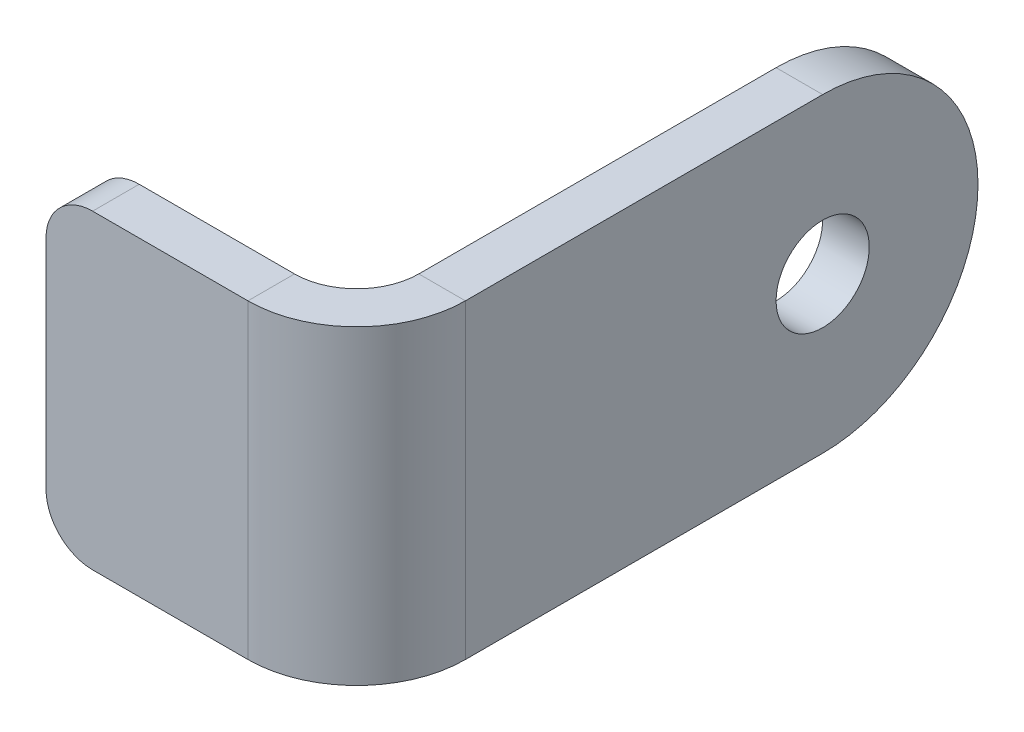
ISO-10303-21;
HEADER;
FILE_DESCRIPTION(('STEP AP214'),'2;1');
FILE_NAME('part.step','',(''),(''),'','','');
FILE_SCHEMA(('AUTOMOTIVE_DESIGN { 1 0 10303 214 1 1 1 1 }'));
ENDSEC;
DATA;
#1=APPLICATION_CONTEXT('core data for automotive mechanical design processes');
#2=APPLICATION_PROTOCOL_DEFINITION('international standard','automotive_design',2000,#1);
#3=PRODUCT_CONTEXT('',#1,'mechanical');
#4=PRODUCT('Part','Part','',(#3));
#5=PRODUCT_RELATED_PRODUCT_CATEGORY('part','',(#4));
#6=PRODUCT_DEFINITION_FORMATION('','',#4);
#7=PRODUCT_DEFINITION_CONTEXT('part definition',#1,'design');
#8=PRODUCT_DEFINITION('design','',#6,#7);
#9=PRODUCT_DEFINITION_SHAPE('','',#8);
#10=(LENGTH_UNIT() NAMED_UNIT(*) SI_UNIT(.MILLI.,.METRE.));
#11=(NAMED_UNIT(*) PLANE_ANGLE_UNIT() SI_UNIT($,.RADIAN.));
#12=(NAMED_UNIT(*) SI_UNIT($,.STERADIAN.) SOLID_ANGLE_UNIT());
#13=UNCERTAINTY_MEASURE_WITH_UNIT(LENGTH_MEASURE(1.E-05),#10,'distance_accuracy_value','');
#14=(GEOMETRIC_REPRESENTATION_CONTEXT(3) GLOBAL_UNCERTAINTY_ASSIGNED_CONTEXT((#13)) GLOBAL_UNIT_ASSIGNED_CONTEXT((#10,
#11,#12)) REPRESENTATION_CONTEXT('',''));
#15=CARTESIAN_POINT('',(0.,0.,0.));
#16=DIRECTION('',(0.,0.,1.));
#17=DIRECTION('',(1.,0.,0.));
#18=AXIS2_PLACEMENT_3D('',#15,#16,#17);
#19=CARTESIAN_POINT('',(-107.000000000002,9.99999999999995,-3.99999999999978));
#20=DIRECTION('',(0.,1.,0.));
#21=DIRECTION('',(0.,0.,1.00000000000001));
#22=AXIS2_PLACEMENT_3D('',#19,#20,#21);
#23=PLANE('',#22);
#24=DIRECTION('',(0.,0.,-1.00000000000001));
#25=VECTOR('',#24,1.);
#26=CARTESIAN_POINT('',(-107.000000000002,9.99999999999995,-3.99999999999978));
#27=LINE('',#26,#25);
#28=CARTESIAN_POINT('',(-107.000000000002,9.99999999999995,-3.99999999999978));
#29=VERTEX_POINT('',#28);
#30=CARTESIAN_POINT('',(-107.000000000002,9.9999999999999,-7.00000000000001));
#31=VERTEX_POINT('',#30);
#32=EDGE_CURVE('E134',#29,#31,#27,.T.);
#33=ORIENTED_EDGE('',*,*,#32,.F.);
#34=CARTESIAN_POINT('',(-107.000000000002,9.99999999999987,-10.9999999999999));
#35=DIRECTION('',(0.,-1.,0.));
#36=DIRECTION('',(0.,0.,-1.00000000000001));
#37=AXIS2_PLACEMENT_3D('',#34,#35,#36);
#38=CIRCLE('',#37,7.);
#39=CARTESIAN_POINT('',(-100.000000000002,10.0000000000007,-10.9999999999998));
#40=VERTEX_POINT('',#39);
#41=EDGE_CURVE('E128',#29,#40,#38,.F.);
#42=ORIENTED_EDGE('',*,*,#41,.T.);
#43=DIRECTION('',(1.00000000000001,0.,0.));
#44=VECTOR('',#43,1.);
#45=CARTESIAN_POINT('',(-103.000000000002,10.0000000000007,-11.));
#46=LINE('',#45,#44);
#47=CARTESIAN_POINT('',(-103.000000000002,10.0000000000007,-11.));
#48=VERTEX_POINT('',#47);
#49=EDGE_CURVE('E122',#48,#40,#46,.T.);
#50=ORIENTED_EDGE('',*,*,#49,.F.);
#51=CARTESIAN_POINT('',(-107.000000000002,9.99999999999987,-10.9999999999999));
#52=DIRECTION('',(0.,1.,0.));
#53=DIRECTION('',(1.00000000000001,0.,0.));
#54=AXIS2_PLACEMENT_3D('',#51,#52,#53);
#55=CIRCLE('',#54,4.);
#56=EDGE_CURVE('E126',#31,#48,#55,.T.);
#57=ORIENTED_EDGE('',*,*,#56,.F.);
#58=EDGE_LOOP('',(#33,#42,#50,#57));
#59=FACE_BOUND('',#58,.T.);
#60=ADVANCED_FACE('F40',(#59),#23,.T.);
#61=CARTESIAN_POINT('',(-103.000000000002,10.0000000000007,-11.));
#62=DIRECTION('',(0.,1.,0.));
#63=DIRECTION('',(0.,0.,1.00000000000001));
#64=AXIS2_PLACEMENT_3D('',#61,#62,#63);
#65=PLANE('',#64);
#66=DIRECTION('',(1.00000000000001,0.,0.));
#67=VECTOR('',#66,1.);
#68=CARTESIAN_POINT('',(-120.000000000002,10.0000000000001,-7.00000000000001));
#69=LINE('',#68,#67);
#70=CARTESIAN_POINT('',(-117.000000000001,9.99999999999993,-6.99999999999978));
#71=VERTEX_POINT('',#70);
#72=EDGE_CURVE('E160',#71,#31,#69,.T.);
#73=ORIENTED_EDGE('',*,*,#72,.F.);
#74=DIRECTION('',(0.,0.,-1.00000000000001));
#75=VECTOR('',#74,1.);
#76=CARTESIAN_POINT('',(-117.000000000002,10.,-10.9999999999998));
#77=LINE('',#76,#75);
#78=CARTESIAN_POINT('',(-117.000000000002,9.99999999999987,-3.99999999999967));
#79=VERTEX_POINT('',#78);
#80=EDGE_CURVE('E230',#71,#79,#77,.F.);
#81=ORIENTED_EDGE('',*,*,#80,.T.);
#82=DIRECTION('',(1.00000000000001,0.,0.));
#83=VECTOR('',#82,1.);
#84=CARTESIAN_POINT('',(-120.000000000002,10.,-4.));
#85=LINE('',#84,#83);
#86=EDGE_CURVE('E164',#79,#29,#85,.T.);
#87=ORIENTED_EDGE('',*,*,#86,.T.);
#88=ORIENTED_EDGE('',*,*,#32,.T.);
#89=EDGE_LOOP('',(#73,#81,#87,#88));
#90=FACE_BOUND('',#89,.T.);
#91=ADVANCED_FACE('F289',(#90),#65,.T.);
#92=CARTESIAN_POINT('',(-100.000000000001,-9.99999999999929,-10.9999999999998));
#93=DIRECTION('',(0.,-1.,0.));
#94=DIRECTION('',(0.,0.,-1.00000000000001));
#95=AXIS2_PLACEMENT_3D('',#92,#93,#94);
#96=PLANE('',#95);
#97=DIRECTION('',(-1.00000000000001,0.,0.));
#98=VECTOR('',#97,1.);
#99=CARTESIAN_POINT('',(-100.000000000001,-9.99999999999929,-10.9999999999998));
#100=LINE('',#99,#98);
#101=CARTESIAN_POINT('',(-100.000000000001,-9.99999999999929,-10.9999999999998));
#102=VERTEX_POINT('',#101);
#103=CARTESIAN_POINT('',(-103.000000000002,-9.99999999999926,-11.));
#104=VERTEX_POINT('',#103);
#105=EDGE_CURVE('E135',#102,#104,#100,.T.);
#106=ORIENTED_EDGE('',*,*,#105,.F.);
#107=CARTESIAN_POINT('',(-107.000000000002,-10.,-11.));
#108=DIRECTION('',(0.,-1.,0.));
#109=DIRECTION('',(0.,0.,-1.00000000000001));
#110=AXIS2_PLACEMENT_3D('',#107,#108,#109);
#111=CIRCLE('',#110,7.);
#112=CARTESIAN_POINT('',(-107.000000000002,-10.,-3.99999999999978));
#113=VERTEX_POINT('',#112);
#114=EDGE_CURVE('E188',#113,#102,#111,.F.);
#115=ORIENTED_EDGE('',*,*,#114,.F.);
#116=DIRECTION('',(0.,0.,1.00000000000001));
#117=VECTOR('',#116,1.);
#118=CARTESIAN_POINT('',(-107.000000000002,-10.,-6.9999999999999));
#119=LINE('',#118,#117);
#120=CARTESIAN_POINT('',(-107.000000000002,-10.,-6.9999999999999));
#121=VERTEX_POINT('',#120);
#122=EDGE_CURVE('E146',#121,#113,#119,.T.);
#123=ORIENTED_EDGE('',*,*,#122,.F.);
#124=CARTESIAN_POINT('',(-107.000000000002,-10.,-11.));
#125=DIRECTION('',(0.,1.,0.));
#126=DIRECTION('',(1.00000000000001,0.,0.));
#127=AXIS2_PLACEMENT_3D('',#124,#125,#126);
#128=CIRCLE('',#127,4.);
#129=EDGE_CURVE('E179',#121,#104,#128,.T.);
#130=ORIENTED_EDGE('',*,*,#129,.T.);
#131=EDGE_LOOP('',(#106,#115,#123,#130));
#132=FACE_BOUND('',#131,.T.);
#133=ADVANCED_FACE('F294',(#132),#96,.T.);
#134=CARTESIAN_POINT('',(-107.000000000002,-10.,-6.9999999999999));
#135=DIRECTION('',(0.,-1.,0.));
#136=DIRECTION('',(0.,0.,-1.00000000000001));
#137=AXIS2_PLACEMENT_3D('',#134,#135,#136);
#138=PLANE('',#137);
#139=DIRECTION('',(0.,0.,-1.00000000000001));
#140=VECTOR('',#139,1.);
#141=CARTESIAN_POINT('',(-103.000000000002,-9.9999999999994,-3.99999999999978));
#142=LINE('',#141,#140);
#143=CARTESIAN_POINT('',(-103.000000000002,-9.99999999999995,-34.));
#144=VERTEX_POINT('',#143);
#145=EDGE_CURVE('E141',#104,#144,#142,.T.);
#146=ORIENTED_EDGE('',*,*,#145,.T.);
#147=DIRECTION('',(1.00000000000001,0.,0.));
#148=VECTOR('',#147,1.);
#149=CARTESIAN_POINT('',(-107.000000000002,-9.99999999999995,-33.9999999999999));
#150=LINE('',#149,#148);
#151=CARTESIAN_POINT('',(-100.000000000001,-10.0000000000001,-34.));
#152=VERTEX_POINT('',#151);
#153=EDGE_CURVE('E11',#144,#152,#150,.T.);
#154=ORIENTED_EDGE('',*,*,#153,.T.);
#155=DIRECTION('',(0.,0.,-1.00000000000001));
#156=VECTOR('',#155,1.);
#157=CARTESIAN_POINT('',(-100.000000000001,-9.99999999999931,-3.99999999999989));
#158=LINE('',#157,#156);
#159=EDGE_CURVE('E173',#102,#152,#158,.T.);
#160=ORIENTED_EDGE('',*,*,#159,.F.);
#161=ORIENTED_EDGE('',*,*,#105,.T.);
#162=EDGE_LOOP('',(#146,#154,#160,#161));
#163=FACE_BOUND('',#162,.T.);
#164=ADVANCED_FACE('F285',(#163),#138,.T.);
#165=CARTESIAN_POINT('',(-100.000000000002,10.0000000000006,-4.));
#166=DIRECTION('',(-1.00000000000001,0.,0.));
#167=DIRECTION('',(0.,0.,1.00000000000001));
#168=AXIS2_PLACEMENT_3D('',#165,#166,#167);
#169=PLANE('',#168);
#170=CARTESIAN_POINT('',(-100.000000000001,0.,-34.0000000000001));
#171=DIRECTION('',(-1.00000000000001,0.,0.));
#172=DIRECTION('',(0.,0.,1.00000000000001));
#173=AXIS2_PLACEMENT_3D('',#170,#171,#172);
#174=CIRCLE('',#173,3.);
#175=CARTESIAN_POINT('',(-100.000000000001,0.,-31.0000000000001));
#176=VERTEX_POINT('',#175);
#177=EDGE_CURVE('E262',#176,#176,#174,.T.);
#178=ORIENTED_EDGE('',*,*,#177,.T.);
#179=EDGE_LOOP('',(#178));
#180=FACE_BOUND('',#179,.T.);
#181=CARTESIAN_POINT('',(-100.000000000001,0.,-34.0000000000001));
#182=DIRECTION('',(-1.00000000000001,0.,0.));
#183=DIRECTION('',(0.,0.,1.00000000000001));
#184=AXIS2_PLACEMENT_3D('',#181,#182,#183);
#185=CIRCLE('',#184,10.);
#186=CARTESIAN_POINT('',(-100.000000000001,0.,-44.0000000000001));
#187=VERTEX_POINT('',#186);
#188=EDGE_CURVE('E243',#152,#187,#185,.F.);
#189=ORIENTED_EDGE('',*,*,#188,.T.);
#190=CARTESIAN_POINT('',(-100.000000000001,0.,-34.0000000000001));
#191=DIRECTION('',(-1.00000000000001,0.,0.));
#192=DIRECTION('',(0.,0.,1.00000000000001));
#193=AXIS2_PLACEMENT_3D('',#190,#191,#192);
#194=CIRCLE('',#193,10.);
#195=CARTESIAN_POINT('',(-100.000000000002,10.,-33.9999999999999));
#196=VERTEX_POINT('',#195);
#197=EDGE_CURVE('E246',#187,#196,#194,.F.);
#198=ORIENTED_EDGE('',*,*,#197,.T.);
#199=DIRECTION('',(0.,0.,-1.00000000000001));
#200=VECTOR('',#199,1.);
#201=CARTESIAN_POINT('',(-100.000000000002,10.0000000000006,-4.));
#202=LINE('',#201,#200);
#203=EDGE_CURVE('E154',#40,#196,#202,.T.);
#204=ORIENTED_EDGE('',*,*,#203,.F.);
#205=DIRECTION('',(0.,-1.,0.));
#206=VECTOR('',#205,1.);
#207=CARTESIAN_POINT('',(-100.000000000002,10.0000000000007,-10.9999999999998));
#208=LINE('',#207,#206);
#209=EDGE_CURVE('E172',#40,#102,#208,.T.);
#210=ORIENTED_EDGE('',*,*,#209,.T.);
#211=ORIENTED_EDGE('',*,*,#159,.T.);
#212=EDGE_LOOP('',(#189,#198,#204,#210,#211));
#213=FACE_BOUND('',#212,.T.);
#214=ADVANCED_FACE('F277',(#180,#213),#169,.F.);
#215=CARTESIAN_POINT('',(-103.000000000001,10.0000000000007,-3.99999999999978));
#216=DIRECTION('',(-1.00000000000001,0.,0.));
#217=DIRECTION('',(0.,0.,1.00000000000001));
#218=AXIS2_PLACEMENT_3D('',#215,#216,#217);
#219=PLANE('',#218);
#220=CARTESIAN_POINT('',(-103.000000000001,0.,-33.9999999999998));
#221=DIRECTION('',(-1.00000000000001,0.,0.));
#222=DIRECTION('',(0.,0.,1.00000000000001));
#223=AXIS2_PLACEMENT_3D('',#220,#221,#222);
#224=CIRCLE('',#223,3.);
#225=CARTESIAN_POINT('',(-103.000000000001,0.,-30.9999999999998));
#226=VERTEX_POINT('',#225);
#227=EDGE_CURVE('E266',#226,#226,#224,.T.);
#228=ORIENTED_EDGE('',*,*,#227,.F.);
#229=EDGE_LOOP('',(#228));
#230=FACE_BOUND('',#229,.T.);
#231=DIRECTION('',(0.,0.,-1.00000000000001));
#232=VECTOR('',#231,1.);
#233=CARTESIAN_POINT('',(-103.000000000001,10.0000000000007,-3.99999999999978));
#234=LINE('',#233,#232);
#235=CARTESIAN_POINT('',(-103.000000000001,9.99999999999995,-33.9999999999999));
#236=VERTEX_POINT('',#235);
#237=EDGE_CURVE('E140',#48,#236,#234,.T.);
#238=ORIENTED_EDGE('',*,*,#237,.T.);
#239=CARTESIAN_POINT('',(-103.000000000001,0.,-33.9999999999998));
#240=DIRECTION('',(-1.00000000000001,0.,0.));
#241=DIRECTION('',(0.,0.,1.00000000000001));
#242=AXIS2_PLACEMENT_3D('',#239,#240,#241);
#243=CIRCLE('',#242,10.);
#244=CARTESIAN_POINT('',(-103.000000000001,0.,-43.9999999999999));
#245=VERTEX_POINT('',#244);
#246=EDGE_CURVE('E50',#236,#245,#243,.T.);
#247=ORIENTED_EDGE('',*,*,#246,.T.);
#248=CARTESIAN_POINT('',(-103.000000000001,0.,-33.9999999999998));
#249=DIRECTION('',(-1.00000000000001,0.,0.));
#250=DIRECTION('',(0.,0.,1.00000000000001));
#251=AXIS2_PLACEMENT_3D('',#248,#249,#250);
#252=CIRCLE('',#251,10.);
#253=EDGE_CURVE('E60',#245,#144,#252,.T.);
#254=ORIENTED_EDGE('',*,*,#253,.T.);
#255=ORIENTED_EDGE('',*,*,#145,.F.);
#256=DIRECTION('',(0.,-1.,0.));
#257=VECTOR('',#256,1.);
#258=CARTESIAN_POINT('',(-103.000000000002,10.0000000000007,-11.));
#259=LINE('',#258,#257);
#260=EDGE_CURVE('E138',#48,#104,#259,.T.);
#261=ORIENTED_EDGE('',*,*,#260,.F.);
#262=EDGE_LOOP('',(#238,#247,#254,#255,#261));
#263=FACE_BOUND('',#262,.T.);
#264=ADVANCED_FACE('F139',(#230,#263),#219,.T.);
#265=CARTESIAN_POINT('',(-107.000000000002,9.99999999999987,-10.9999999999999));
#266=DIRECTION('',(0.,-1.,0.));
#267=DIRECTION('',(0.,0.,-1.00000000000001));
#268=AXIS2_PLACEMENT_3D('',#265,#266,#267);
#269=CYLINDRICAL_SURFACE('',#268,4.);
#270=ORIENTED_EDGE('',*,*,#129,.F.);
#271=DIRECTION('',(0.,-1.,0.));
#272=VECTOR('',#271,1.);
#273=CARTESIAN_POINT('',(-107.000000000002,9.9999999999999,-7.00000000000001));
#274=LINE('',#273,#272);
#275=EDGE_CURVE('E147',#31,#121,#274,.T.);
#276=ORIENTED_EDGE('',*,*,#275,.F.);
#277=ORIENTED_EDGE('',*,*,#56,.T.);
#278=ORIENTED_EDGE('',*,*,#260,.T.);
#279=EDGE_LOOP('',(#270,#276,#277,#278));
#280=FACE_BOUND('',#279,.T.);
#281=ADVANCED_FACE('F157',(#280),#269,.F.);
#282=CARTESIAN_POINT('',(-120.000000000002,10.0000000000001,-7.00000000000001));
#283=DIRECTION('',(0.,0.,-1.00000000000001));
#284=DIRECTION('',(-1.00000000000001,0.,0.));
#285=AXIS2_PLACEMENT_3D('',#282,#283,#284);
#286=PLANE('',#285);
#287=DIRECTION('',(0.,-1.,0.));
#288=VECTOR('',#287,1.);
#289=CARTESIAN_POINT('',(-120.000000000002,10.0000000000001,-7.00000000000001));
#290=LINE('',#289,#288);
#291=CARTESIAN_POINT('',(-120.000000000002,6.99999999999995,-6.99999999999978));
#292=VERTEX_POINT('',#291);
#293=CARTESIAN_POINT('',(-120.000000000002,-7.00000000000012,-6.9999999999999));
#294=VERTEX_POINT('',#293);
#295=EDGE_CURVE('E203',#292,#294,#290,.T.);
#296=ORIENTED_EDGE('',*,*,#295,.F.);
#297=CARTESIAN_POINT('',(-117.000000000002,7.00000000000001,-7.00000000000001));
#298=DIRECTION('',(0.,0.,-1.00000000000001));
#299=DIRECTION('',(-1.00000000000001,0.,0.));
#300=AXIS2_PLACEMENT_3D('',#297,#298,#299);
#301=CIRCLE('',#300,3.);
#302=EDGE_CURVE('E227',#292,#71,#301,.T.);
#303=ORIENTED_EDGE('',*,*,#302,.T.);
#304=ORIENTED_EDGE('',*,*,#72,.T.);
#305=ORIENTED_EDGE('',*,*,#275,.T.);
#306=DIRECTION('',(1.00000000000001,0.,0.));
#307=VECTOR('',#306,1.);
#308=CARTESIAN_POINT('',(-120.000000000002,-10.,-7.00000000000001));
#309=LINE('',#308,#307);
#310=CARTESIAN_POINT('',(-117.000000000002,-10.0000000000001,-6.99999999999978));
#311=VERTEX_POINT('',#310);
#312=EDGE_CURVE('E182',#311,#121,#309,.T.);
#313=ORIENTED_EDGE('',*,*,#312,.F.);
#314=CARTESIAN_POINT('',(-117.000000000002,-7.00000000000003,-6.9999999999999));
#315=DIRECTION('',(0.,0.,-1.00000000000001));
#316=DIRECTION('',(-1.00000000000001,0.,0.));
#317=AXIS2_PLACEMENT_3D('',#314,#315,#316);
#318=CIRCLE('',#317,3.);
#319=EDGE_CURVE('E224',#311,#294,#318,.T.);
#320=ORIENTED_EDGE('',*,*,#319,.T.);
#321=EDGE_LOOP('',(#296,#303,#304,#305,#313,#320));
#322=FACE_BOUND('',#321,.T.);
#323=ADVANCED_FACE('F283',(#322),#286,.T.);
#324=CARTESIAN_POINT('',(-120.000000000002,10.,-4.));
#325=DIRECTION('',(-1.00000000000001,0.,0.));
#326=DIRECTION('',(0.,0.,1.00000000000001));
#327=AXIS2_PLACEMENT_3D('',#324,#325,#326);
#328=PLANE('',#327);
#329=DIRECTION('',(0.,-1.,0.));
#330=VECTOR('',#329,1.);
#331=CARTESIAN_POINT('',(-120.000000000002,10.,-4.));
#332=LINE('',#331,#330);
#333=CARTESIAN_POINT('',(-120.000000000002,7.00000000000001,-3.99999999999967));
#334=VERTEX_POINT('',#333);
#335=CARTESIAN_POINT('',(-120.000000000002,-6.99999999999998,-3.99999999999978));
#336=VERTEX_POINT('',#335);
#337=EDGE_CURVE('E199',#334,#336,#332,.T.);
#338=ORIENTED_EDGE('',*,*,#337,.F.);
#339=DIRECTION('',(0.,0.,-1.00000000000001));
#340=VECTOR('',#339,1.);
#341=CARTESIAN_POINT('',(-120.000000000002,7.00000000000001,-3.99999999999967));
#342=LINE('',#341,#340);
#343=EDGE_CURVE('E220',#334,#292,#342,.T.);
#344=ORIENTED_EDGE('',*,*,#343,.T.);
#345=ORIENTED_EDGE('',*,*,#295,.T.);
#346=DIRECTION('',(0.,0.,-1.00000000000001));
#347=VECTOR('',#346,1.);
#348=CARTESIAN_POINT('',(-120.000000000002,-6.99999999999998,-3.99999999999978));
#349=LINE('',#348,#347);
#350=EDGE_CURVE('E217',#294,#336,#349,.F.);
#351=ORIENTED_EDGE('',*,*,#350,.T.);
#352=EDGE_LOOP('',(#338,#344,#345,#351));
#353=FACE_BOUND('',#352,.T.);
#354=ADVANCED_FACE('F346',(#353),#328,.T.);
#355=CARTESIAN_POINT('',(-120.000000000002,10.,-4.));
#356=DIRECTION('',(0.,0.,-1.00000000000001));
#357=DIRECTION('',(-1.00000000000001,0.,0.));
#358=AXIS2_PLACEMENT_3D('',#355,#356,#357);
#359=PLANE('',#358);
#360=ORIENTED_EDGE('',*,*,#86,.F.);
#361=CARTESIAN_POINT('',(-117.000000000002,7.00000000000001,-3.99999999999989));
#362=DIRECTION('',(0.,0.,-1.00000000000001));
#363=DIRECTION('',(-1.00000000000001,0.,0.));
#364=AXIS2_PLACEMENT_3D('',#361,#362,#363);
#365=CIRCLE('',#364,3.);
#366=EDGE_CURVE('E236',#79,#334,#365,.F.);
#367=ORIENTED_EDGE('',*,*,#366,.T.);
#368=ORIENTED_EDGE('',*,*,#337,.T.);
#369=CARTESIAN_POINT('',(-117.000000000002,-6.99999999999998,-4.));
#370=DIRECTION('',(0.,0.,-1.00000000000001));
#371=DIRECTION('',(-1.00000000000001,0.,0.));
#372=AXIS2_PLACEMENT_3D('',#369,#370,#371);
#373=CIRCLE('',#372,3.);
#374=CARTESIAN_POINT('',(-117.000000000002,-10.0000000000001,-4.00000000000011));
#375=VERTEX_POINT('',#374);
#376=EDGE_CURVE('E233',#336,#375,#373,.F.);
#377=ORIENTED_EDGE('',*,*,#376,.T.);
#378=DIRECTION('',(1.00000000000001,0.,0.));
#379=VECTOR('',#378,1.);
#380=CARTESIAN_POINT('',(-120.000000000002,-10.,-3.99999999999989));
#381=LINE('',#380,#379);
#382=EDGE_CURVE('E185',#375,#113,#381,.T.);
#383=ORIENTED_EDGE('',*,*,#382,.T.);
#384=DIRECTION('',(0.,-1.,0.));
#385=VECTOR('',#384,1.);
#386=CARTESIAN_POINT('',(-107.000000000002,9.99999999999995,-3.99999999999978));
#387=LINE('',#386,#385);
#388=EDGE_CURVE('E195',#29,#113,#387,.T.);
#389=ORIENTED_EDGE('',*,*,#388,.F.);
#390=EDGE_LOOP('',(#360,#367,#368,#377,#383,#389));
#391=FACE_BOUND('',#390,.T.);
#392=ADVANCED_FACE('F339',(#391),#359,.F.);
#393=CARTESIAN_POINT('',(-107.000000000002,9.99999999999987,-10.9999999999999));
#394=DIRECTION('',(0.,-1.,0.));
#395=DIRECTION('',(0.,0.,-1.00000000000001));
#396=AXIS2_PLACEMENT_3D('',#393,#394,#395);
#397=CYLINDRICAL_SURFACE('',#396,7.);
#398=ORIENTED_EDGE('',*,*,#114,.T.);
#399=ORIENTED_EDGE('',*,*,#209,.F.);
#400=ORIENTED_EDGE('',*,*,#41,.F.);
#401=ORIENTED_EDGE('',*,*,#388,.T.);
#402=EDGE_LOOP('',(#398,#399,#400,#401));
#403=FACE_BOUND('',#402,.T.);
#404=ADVANCED_FACE('F325',(#403),#397,.T.);
#405=CARTESIAN_POINT('',(-107.000000000002,9.99999999999987,-10.9999999999999));
#406=DIRECTION('',(0.,1.,0.));
#407=DIRECTION('',(1.00000000000001,0.,0.));
#408=AXIS2_PLACEMENT_3D('',#405,#406,#407);
#409=PLANE('',#408);
#410=ORIENTED_EDGE('',*,*,#203,.T.);
#411=DIRECTION('',(1.00000000000001,0.,0.));
#412=VECTOR('',#411,1.);
#413=CARTESIAN_POINT('',(-107.000000000001,9.9999999999999,-33.9999999999999));
#414=LINE('',#413,#412);
#415=EDGE_CURVE('E152',#196,#236,#414,.F.);
#416=ORIENTED_EDGE('',*,*,#415,.T.);
#417=ORIENTED_EDGE('',*,*,#237,.F.);
#418=ORIENTED_EDGE('',*,*,#49,.T.);
#419=EDGE_LOOP('',(#410,#416,#417,#418));
#420=FACE_BOUND('',#419,.T.);
#421=ADVANCED_FACE('F150',(#420),#409,.T.);
#422=CARTESIAN_POINT('',(-107.000000000002,-10.,-11.));
#423=DIRECTION('',(0.,1.,0.));
#424=DIRECTION('',(1.00000000000001,0.,0.));
#425=AXIS2_PLACEMENT_3D('',#422,#423,#424);
#426=PLANE('',#425);
#427=ORIENTED_EDGE('',*,*,#382,.F.);
#428=DIRECTION('',(0.,0.,-1.00000000000001));
#429=VECTOR('',#428,1.);
#430=CARTESIAN_POINT('',(-117.000000000002,-10.0000000000001,-6.99999999999978));
#431=LINE('',#430,#429);
#432=EDGE_CURVE('E239',#375,#311,#431,.T.);
#433=ORIENTED_EDGE('',*,*,#432,.T.);
#434=ORIENTED_EDGE('',*,*,#312,.T.);
#435=ORIENTED_EDGE('',*,*,#122,.T.);
#436=EDGE_LOOP('',(#427,#433,#434,#435));
#437=FACE_BOUND('',#436,.T.);
#438=ADVANCED_FACE('F303',(#437),#426,.F.);
#439=CARTESIAN_POINT('',(-117.000000000002,7.00000000000001,-3.99999999999989));
#440=DIRECTION('',(0.,0.,-1.00000000000001));
#441=DIRECTION('',(-1.00000000000001,0.,0.));
#442=AXIS2_PLACEMENT_3D('',#439,#440,#441);
#443=CYLINDRICAL_SURFACE('',#442,3.);
#444=ORIENTED_EDGE('',*,*,#366,.F.);
#445=ORIENTED_EDGE('',*,*,#80,.F.);
#446=ORIENTED_EDGE('',*,*,#302,.F.);
#447=ORIENTED_EDGE('',*,*,#343,.F.);
#448=EDGE_LOOP('',(#444,#445,#446,#447));
#449=FACE_BOUND('',#448,.T.);
#450=ADVANCED_FACE('F299',(#449),#443,.T.);
#451=CARTESIAN_POINT('',(-117.000000000002,-7.00000000000009,-10.9999999999998));
#452=DIRECTION('',(0.,0.,1.00000000000001));
#453=DIRECTION('',(1.00000000000001,0.,0.));
#454=AXIS2_PLACEMENT_3D('',#451,#452,#453);
#455=CYLINDRICAL_SURFACE('',#454,3.);
#456=ORIENTED_EDGE('',*,*,#376,.F.);
#457=ORIENTED_EDGE('',*,*,#350,.F.);
#458=ORIENTED_EDGE('',*,*,#319,.F.);
#459=ORIENTED_EDGE('',*,*,#432,.F.);
#460=EDGE_LOOP('',(#456,#457,#458,#459));
#461=FACE_BOUND('',#460,.T.);
#462=ADVANCED_FACE('F302',(#461),#455,.T.);
#463=CARTESIAN_POINT('',(-107.000000000001,0.,-34.));
#464=DIRECTION('',(1.00000000000001,0.,0.));
#465=DIRECTION('',(0.,0.,-1.00000000000001));
#466=AXIS2_PLACEMENT_3D('',#463,#464,#465);
#467=CYLINDRICAL_SURFACE('',#466,10.);
#468=ORIENTED_EDGE('',*,*,#153,.F.);
#469=ORIENTED_EDGE('',*,*,#253,.F.);
#470=DIRECTION('',(1.00000000000001,0.,0.));
#471=VECTOR('',#470,1.);
#472=CARTESIAN_POINT('',(-103.000000000001,0.,-43.9999999999999));
#473=LINE('',#472,#471);
#474=EDGE_CURVE('E44',#187,#245,#473,.F.);
#475=ORIENTED_EDGE('',*,*,#474,.F.);
#476=ORIENTED_EDGE('',*,*,#188,.F.);
#477=EDGE_LOOP('',(#468,#469,#475,#476));
#478=FACE_BOUND('',#477,.T.);
#479=ADVANCED_FACE('F42',(#478),#467,.T.);
#480=CARTESIAN_POINT('',(-103.000000000001,0.,-33.9999999999998));
#481=DIRECTION('',(1.00000000000001,0.,0.));
#482=DIRECTION('',(0.,0.,-1.00000000000001));
#483=AXIS2_PLACEMENT_3D('',#480,#481,#482);
#484=CYLINDRICAL_SURFACE('',#483,10.);
#485=ORIENTED_EDGE('',*,*,#246,.F.);
#486=ORIENTED_EDGE('',*,*,#415,.F.);
#487=ORIENTED_EDGE('',*,*,#197,.F.);
#488=ORIENTED_EDGE('',*,*,#474,.T.);
#489=EDGE_LOOP('',(#485,#486,#487,#488));
#490=FACE_BOUND('',#489,.T.);
#491=ADVANCED_FACE('F307',(#490),#484,.T.);
#492=CARTESIAN_POINT('',(-99.0000000000014,0.,-33.9999999999998));
#493=DIRECTION('',(-1.00000000000001,0.,0.));
#494=DIRECTION('',(0.,0.,1.00000000000001));
#495=AXIS2_PLACEMENT_3D('',#492,#493,#494);
#496=CYLINDRICAL_SURFACE('',#495,3.);
#497=ORIENTED_EDGE('',*,*,#227,.T.);
#498=EDGE_LOOP('',(#497));
#499=FACE_BOUND('',#498,.T.);
#500=ORIENTED_EDGE('',*,*,#177,.F.);
#501=EDGE_LOOP('',(#500));
#502=FACE_BOUND('',#501,.T.);
#503=ADVANCED_FACE('F273',(#499,#502),#496,.F.);
#504=CLOSED_SHELL('',(#60,#91,#133,#164,#214,#264,#281,#323,#354,#392,#404,#421,#438,#450,#462,
#479,#491,#503));
#505=MANIFOLD_SOLID_BREP('B2',#504);
#506=ADVANCED_BREP_SHAPE_REPRESENTATION('',(#18,#505),#14);
#507=SHAPE_DEFINITION_REPRESENTATION(#9,#506);
ENDSEC;
END-ISO-10303-21;
